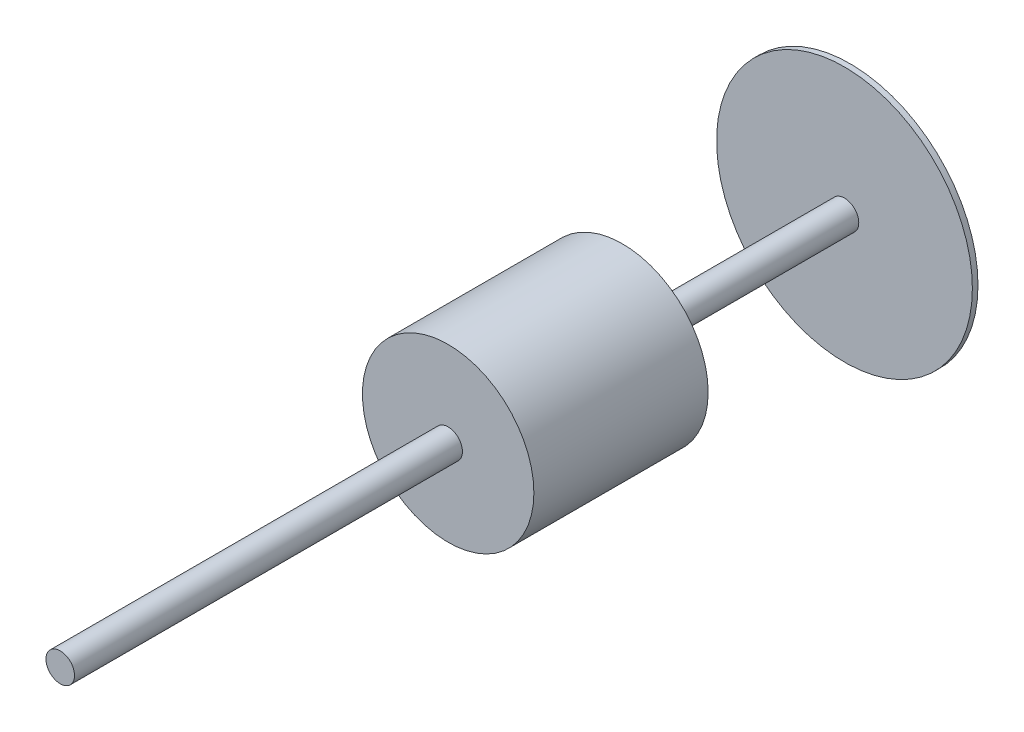
ISO-10303-21;
HEADER;
FILE_DESCRIPTION(('STEP AP214'),'2;1');
FILE_NAME('part.step','',(''),(''),'','','');
FILE_SCHEMA(('AUTOMOTIVE_DESIGN { 1 0 10303 214 1 1 1 1 }'));
ENDSEC;
DATA;
#1=APPLICATION_CONTEXT('core data for automotive mechanical design processes');
#2=APPLICATION_PROTOCOL_DEFINITION('international standard','automotive_design',2000,#1);
#3=PRODUCT_CONTEXT('',#1,'mechanical');
#4=PRODUCT('Part','Part','',(#3));
#5=PRODUCT_RELATED_PRODUCT_CATEGORY('part','',(#4));
#6=PRODUCT_DEFINITION_FORMATION('','',#4);
#7=PRODUCT_DEFINITION_CONTEXT('part definition',#1,'design');
#8=PRODUCT_DEFINITION('design','',#6,#7);
#9=PRODUCT_DEFINITION_SHAPE('','',#8);
#10=(LENGTH_UNIT() NAMED_UNIT(*) SI_UNIT(.MILLI.,.METRE.));
#11=(NAMED_UNIT(*) PLANE_ANGLE_UNIT() SI_UNIT($,.RADIAN.));
#12=(NAMED_UNIT(*) SI_UNIT($,.STERADIAN.) SOLID_ANGLE_UNIT());
#13=UNCERTAINTY_MEASURE_WITH_UNIT(LENGTH_MEASURE(1.E-05),#10,'distance_accuracy_value','');
#14=(GEOMETRIC_REPRESENTATION_CONTEXT(3) GLOBAL_UNCERTAINTY_ASSIGNED_CONTEXT((#13)) GLOBAL_UNIT_ASSIGNED_CONTEXT((#10,
#11,#12)) REPRESENTATION_CONTEXT('',''));
#15=CARTESIAN_POINT('',(0.,0.,0.));
#16=DIRECTION('',(0.,0.,1.));
#17=DIRECTION('',(1.,0.,0.));
#18=AXIS2_PLACEMENT_3D('',#15,#16,#17);
#19=CARTESIAN_POINT('',(0.,0.,130.));
#20=DIRECTION('',(0.,0.,1.));
#21=DIRECTION('',(1.,0.,0.));
#22=AXIS2_PLACEMENT_3D('',#19,#20,#21);
#23=CYLINDRICAL_SURFACE('',#22,305.);
#24=CARTESIAN_POINT('',(0.,0.,130.));
#25=DIRECTION('',(0.,0.,1.));
#26=DIRECTION('',(1.,0.,0.));
#27=AXIS2_PLACEMENT_3D('',#24,#25,#26);
#28=CIRCLE('',#27,305.);
#29=CARTESIAN_POINT('',(305.,0.,130.));
#30=VERTEX_POINT('',#29);
#31=EDGE_CURVE('E67',#30,#30,#28,.T.);
#32=ORIENTED_EDGE('',*,*,#31,.T.);
#33=EDGE_LOOP('',(#32));
#34=FACE_BOUND('',#33,.T.);
#35=CARTESIAN_POINT('',(0.,0.,750.));
#36=DIRECTION('',(0.,0.,1.));
#37=DIRECTION('',(1.,0.,0.));
#38=AXIS2_PLACEMENT_3D('',#35,#36,#37);
#39=CIRCLE('',#38,305.);
#40=CARTESIAN_POINT('',(305.,0.,750.));
#41=VERTEX_POINT('',#40);
#42=EDGE_CURVE('E78',#41,#41,#39,.T.);
#43=ORIENTED_EDGE('',*,*,#42,.F.);
#44=EDGE_LOOP('',(#43));
#45=FACE_BOUND('',#44,.T.);
#46=ADVANCED_FACE('F45',(#34,#45),#23,.T.);
#47=CARTESIAN_POINT('',(0.,0.,130.));
#48=DIRECTION('',(0.,0.,1.));
#49=DIRECTION('',(1.,0.,0.));
#50=AXIS2_PLACEMENT_3D('',#47,#48,#49);
#51=PLANE('',#50);
#52=CARTESIAN_POINT('',(0.,0.,130.));
#53=DIRECTION('',(0.,0.,1.));
#54=DIRECTION('',(1.,0.,0.));
#55=AXIS2_PLACEMENT_3D('',#52,#53,#54);
#56=CIRCLE('',#55,225.);
#57=CARTESIAN_POINT('',(225.,0.,130.));
#58=VERTEX_POINT('',#57);
#59=EDGE_CURVE('E10',#58,#58,#56,.F.);
#60=ORIENTED_EDGE('',*,*,#59,.F.);
#61=EDGE_LOOP('',(#60));
#62=FACE_BOUND('',#61,.T.);
#63=ORIENTED_EDGE('',*,*,#31,.F.);
#64=EDGE_LOOP('',(#63));
#65=FACE_BOUND('',#64,.T.);
#66=ADVANCED_FACE('F113',(#62,#65),#51,.F.);
#67=CARTESIAN_POINT('',(0.,0.,750.));
#68=DIRECTION('',(0.,0.,1.));
#69=DIRECTION('',(1.,0.,0.));
#70=AXIS2_PLACEMENT_3D('',#67,#68,#69);
#71=PLANE('',#70);
#72=CARTESIAN_POINT('',(0.,0.,750.));
#73=DIRECTION('',(0.,0.,1.));
#74=DIRECTION('',(1.,0.,0.));
#75=AXIS2_PLACEMENT_3D('',#72,#73,#74);
#76=CIRCLE('',#75,50.8);
#77=CARTESIAN_POINT('',(50.8,0.,750.));
#78=VERTEX_POINT('',#77);
#79=EDGE_CURVE('E62',#78,#78,#76,.T.);
#80=ORIENTED_EDGE('',*,*,#79,.F.);
#81=EDGE_LOOP('',(#80));
#82=FACE_BOUND('',#81,.T.);
#83=ORIENTED_EDGE('',*,*,#42,.T.);
#84=EDGE_LOOP('',(#83));
#85=FACE_BOUND('',#84,.T.);
#86=ADVANCED_FACE('F120',(#82,#85),#71,.T.);
#87=CARTESIAN_POINT('',(0.,0.,2130.));
#88=DIRECTION('',(0.,0.,1.));
#89=DIRECTION('',(1.,0.,0.));
#90=AXIS2_PLACEMENT_3D('',#87,#88,#89);
#91=PLANE('',#90);
#92=CARTESIAN_POINT('',(0.,0.,2130.));
#93=DIRECTION('',(0.,0.,1.));
#94=DIRECTION('',(1.,0.,0.));
#95=AXIS2_PLACEMENT_3D('',#92,#93,#94);
#96=CIRCLE('',#95,50.8);
#97=CARTESIAN_POINT('',(50.8,0.,2130.));
#98=VERTEX_POINT('',#97);
#99=EDGE_CURVE('E54',#98,#98,#96,.T.);
#100=ORIENTED_EDGE('',*,*,#99,.T.);
#101=EDGE_LOOP('',(#100));
#102=FACE_BOUND('',#101,.T.);
#103=ADVANCED_FACE('F132',(#102),#91,.T.);
#104=CARTESIAN_POINT('',(0.,0.,2130.));
#105=DIRECTION('',(0.,0.,-1.));
#106=DIRECTION('',(-1.,0.,0.));
#107=AXIS2_PLACEMENT_3D('',#104,#105,#106);
#108=CYLINDRICAL_SURFACE('',#107,50.8);
#109=ORIENTED_EDGE('',*,*,#79,.T.);
#110=EDGE_LOOP('',(#109));
#111=FACE_BOUND('',#110,.T.);
#112=ORIENTED_EDGE('',*,*,#99,.F.);
#113=EDGE_LOOP('',(#112));
#114=FACE_BOUND('',#113,.T.);
#115=ADVANCED_FACE('F47',(#111,#114),#108,.T.);
#116=CARTESIAN_POINT('',(0.,0.,80.));
#117=DIRECTION('',(0.,0.,1.));
#118=DIRECTION('',(1.,0.,0.));
#119=AXIS2_PLACEMENT_3D('',#116,#117,#118);
#120=CYLINDRICAL_SURFACE('',#119,225.);
#121=CARTESIAN_POINT('',(0.,0.,80.));
#122=DIRECTION('',(0.,0.,-1.));
#123=DIRECTION('',(-1.,0.,0.));
#124=AXIS2_PLACEMENT_3D('',#121,#122,#123);
#125=CIRCLE('',#124,225.);
#126=CARTESIAN_POINT('',(-225.,0.,80.));
#127=VERTEX_POINT('',#126);
#128=EDGE_CURVE('E85',#127,#127,#125,.T.);
#129=ORIENTED_EDGE('',*,*,#128,.F.);
#130=EDGE_LOOP('',(#129));
#131=FACE_BOUND('',#130,.T.);
#132=ORIENTED_EDGE('',*,*,#59,.T.);
#133=EDGE_LOOP('',(#132));
#134=FACE_BOUND('',#133,.T.);
#135=ADVANCED_FACE('F100',(#131,#134),#120,.T.);
#136=CARTESIAN_POINT('',(0.,0.,80.));
#137=DIRECTION('',(0.,0.,-1.));
#138=DIRECTION('',(-1.,0.,0.));
#139=AXIS2_PLACEMENT_3D('',#136,#137,#138);
#140=PLANE('',#139);
#141=CARTESIAN_POINT('',(0.,0.,80.0000000000001));
#142=DIRECTION('',(0.,0.,-1.));
#143=DIRECTION('',(-1.,0.,0.));
#144=AXIS2_PLACEMENT_3D('',#141,#142,#143);
#145=CIRCLE('',#144,50.8);
#146=CARTESIAN_POINT('',(-50.8,0.,80.0000000000001));
#147=VERTEX_POINT('',#146);
#148=EDGE_CURVE('E49',#147,#147,#145,.T.);
#149=ORIENTED_EDGE('',*,*,#148,.F.);
#150=EDGE_LOOP('',(#149));
#151=FACE_BOUND('',#150,.T.);
#152=ORIENTED_EDGE('',*,*,#128,.T.);
#153=EDGE_LOOP('',(#152));
#154=FACE_BOUND('',#153,.T.);
#155=ADVANCED_FACE('F97',(#151,#154),#140,.T.);
#156=CARTESIAN_POINT('',(0.,0.,-680.));
#157=DIRECTION('',(0.,0.,1.));
#158=DIRECTION('',(1.,0.,0.));
#159=AXIS2_PLACEMENT_3D('',#156,#157,#158);
#160=PLANE('',#159);
#161=CARTESIAN_POINT('',(0.,0.,-680.));
#162=DIRECTION('',(0.,0.,1.));
#163=DIRECTION('',(1.,0.,0.));
#164=AXIS2_PLACEMENT_3D('',#161,#162,#163);
#165=CIRCLE('',#164,455.);
#166=CARTESIAN_POINT('',(455.,0.,-680.));
#167=VERTEX_POINT('',#166);
#168=EDGE_CURVE('E66',#167,#167,#165,.T.);
#169=ORIENTED_EDGE('',*,*,#168,.F.);
#170=EDGE_LOOP('',(#169));
#171=FACE_BOUND('',#170,.T.);
#172=ADVANCED_FACE('F99',(#171),#160,.F.);
#173=CARTESIAN_POINT('',(0.,0.,-660.));
#174=DIRECTION('',(0.,0.,-1.));
#175=DIRECTION('',(-1.,0.,0.));
#176=AXIS2_PLACEMENT_3D('',#173,#174,#175);
#177=CYLINDRICAL_SURFACE('',#176,455.);
#178=CARTESIAN_POINT('',(0.,0.,-660.));
#179=DIRECTION('',(0.,0.,1.));
#180=DIRECTION('',(1.,0.,0.));
#181=AXIS2_PLACEMENT_3D('',#178,#179,#180);
#182=CIRCLE('',#181,455.);
#183=CARTESIAN_POINT('',(455.,0.,-660.));
#184=VERTEX_POINT('',#183);
#185=EDGE_CURVE('E70',#184,#184,#182,.T.);
#186=ORIENTED_EDGE('',*,*,#185,.F.);
#187=EDGE_LOOP('',(#186));
#188=FACE_BOUND('',#187,.T.);
#189=ORIENTED_EDGE('',*,*,#168,.T.);
#190=EDGE_LOOP('',(#189));
#191=FACE_BOUND('',#190,.T.);
#192=ADVANCED_FACE('F107',(#188,#191),#177,.T.);
#193=CARTESIAN_POINT('',(0.,0.,-660.));
#194=DIRECTION('',(0.,0.,1.));
#195=DIRECTION('',(1.,0.,0.));
#196=AXIS2_PLACEMENT_3D('',#193,#194,#195);
#197=PLANE('',#196);
#198=CARTESIAN_POINT('',(0.,0.,-660.));
#199=DIRECTION('',(0.,0.,1.));
#200=DIRECTION('',(1.,0.,0.));
#201=AXIS2_PLACEMENT_3D('',#198,#199,#200);
#202=CIRCLE('',#201,50.8);
#203=CARTESIAN_POINT('',(50.8,0.,-660.));
#204=VERTEX_POINT('',#203);
#205=EDGE_CURVE('E59',#204,#204,#202,.T.);
#206=ORIENTED_EDGE('',*,*,#205,.F.);
#207=EDGE_LOOP('',(#206));
#208=FACE_BOUND('',#207,.T.);
#209=ORIENTED_EDGE('',*,*,#185,.T.);
#210=EDGE_LOOP('',(#209));
#211=FACE_BOUND('',#210,.T.);
#212=ADVANCED_FACE('F126',(#208,#211),#197,.T.);
#213=ORIENTED_EDGE('',*,*,#148,.T.);
#214=EDGE_LOOP('',(#213));
#215=FACE_BOUND('',#214,.T.);
#216=ORIENTED_EDGE('',*,*,#205,.T.);
#217=EDGE_LOOP('',(#216));
#218=FACE_BOUND('',#217,.T.);
#219=ADVANCED_FACE('F94',(#215,#218),#108,.T.);
#220=CLOSED_SHELL('',(#46,#66,#86,#103,#115,#135,#155,#172,#192,#212,#219));
#221=MANIFOLD_SOLID_BREP('B2',#220);
#222=ADVANCED_BREP_SHAPE_REPRESENTATION('',(#18,#221),#14);
#223=SHAPE_DEFINITION_REPRESENTATION(#9,#222);
ENDSEC;
END-ISO-10303-21;
